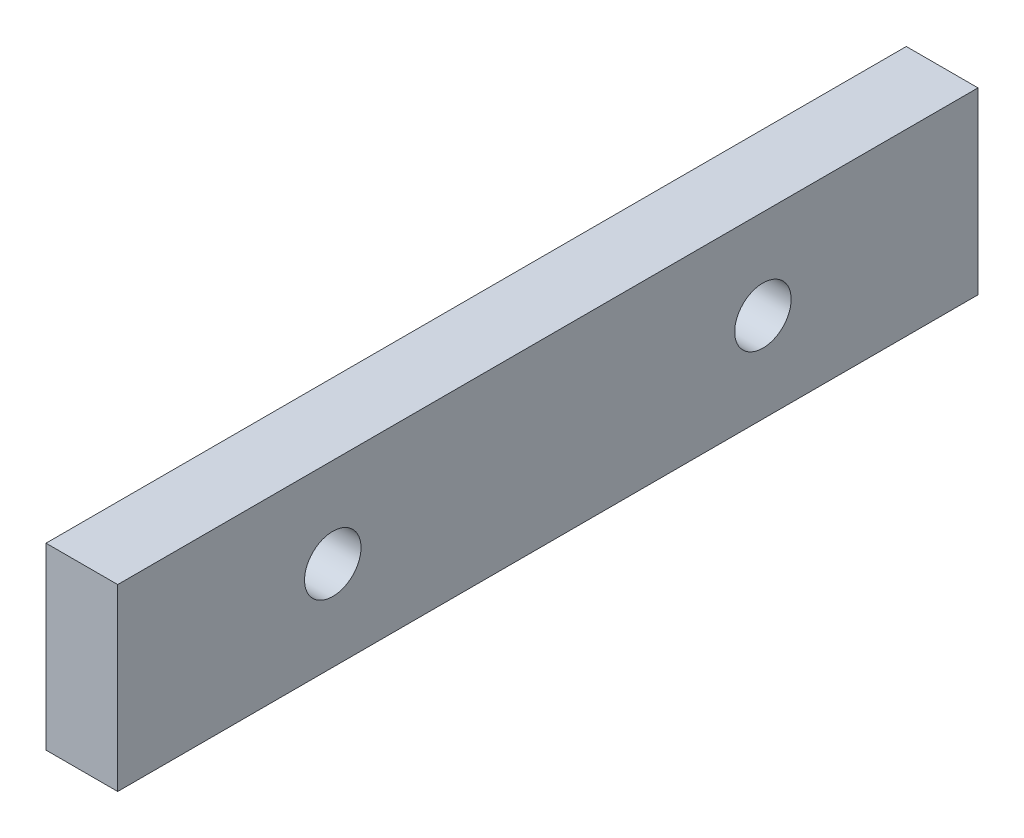
ISO-10303-21;
HEADER;
FILE_DESCRIPTION(('STEP AP214'),'2;1');
FILE_NAME('part.step','',(''),(''),'','','');
FILE_SCHEMA(('AUTOMOTIVE_DESIGN { 1 0 10303 214 1 1 1 1 }'));
ENDSEC;
DATA;
#1=APPLICATION_CONTEXT('core data for automotive mechanical design processes');
#2=APPLICATION_PROTOCOL_DEFINITION('international standard','automotive_design',2000,#1);
#3=PRODUCT_CONTEXT('',#1,'mechanical');
#4=PRODUCT('Part','Part','',(#3));
#5=PRODUCT_RELATED_PRODUCT_CATEGORY('part','',(#4));
#6=PRODUCT_DEFINITION_FORMATION('','',#4);
#7=PRODUCT_DEFINITION_CONTEXT('part definition',#1,'design');
#8=PRODUCT_DEFINITION('design','',#6,#7);
#9=PRODUCT_DEFINITION_SHAPE('','',#8);
#10=(LENGTH_UNIT() NAMED_UNIT(*) SI_UNIT(.MILLI.,.METRE.));
#11=(NAMED_UNIT(*) PLANE_ANGLE_UNIT() SI_UNIT($,.RADIAN.));
#12=(NAMED_UNIT(*) SI_UNIT($,.STERADIAN.) SOLID_ANGLE_UNIT());
#13=UNCERTAINTY_MEASURE_WITH_UNIT(LENGTH_MEASURE(1.E-05),#10,'distance_accuracy_value','');
#14=(GEOMETRIC_REPRESENTATION_CONTEXT(3) GLOBAL_UNCERTAINTY_ASSIGNED_CONTEXT((#13)) GLOBAL_UNIT_ASSIGNED_CONTEXT((#10,
#11,#12)) REPRESENTATION_CONTEXT('',''));
#15=CARTESIAN_POINT('',(0.,0.,0.));
#16=DIRECTION('',(0.,0.,1.));
#17=DIRECTION('',(1.,0.,0.));
#18=AXIS2_PLACEMENT_3D('',#15,#16,#17);
#19=CARTESIAN_POINT('',(3.175,7.9375,38.1));
#20=DIRECTION('',(-1.,0.,0.));
#21=DIRECTION('',(0.,-1.,0.));
#22=AXIS2_PLACEMENT_3D('',#19,#20,#21);
#23=PLANE('',#22);
#24=CARTESIAN_POINT('',(3.175,0.,19.05));
#25=DIRECTION('',(1.,0.,0.));
#26=DIRECTION('',(0.,0.,-1.));
#27=AXIS2_PLACEMENT_3D('',#24,#25,#26);
#28=CIRCLE('',#27,2.49999999999999);
#29=CARTESIAN_POINT('',(3.175,0.,16.55));
#30=VERTEX_POINT('',#29);
#31=EDGE_CURVE('E142',#30,#30,#28,.T.);
#32=ORIENTED_EDGE('',*,*,#31,.F.);
#33=EDGE_LOOP('',(#32));
#34=FACE_BOUND('',#33,.T.);
#35=DIRECTION('',(0.,1.,0.));
#36=VECTOR('',#35,1.);
#37=CARTESIAN_POINT('',(3.175,7.9375,-38.1));
#38=LINE('',#37,#36);
#39=CARTESIAN_POINT('',(3.175,-7.9375,-38.1));
#40=VERTEX_POINT('',#39);
#41=CARTESIAN_POINT('',(3.175,7.9375,-38.1));
#42=VERTEX_POINT('',#41);
#43=EDGE_CURVE('E109',#40,#42,#38,.T.);
#44=ORIENTED_EDGE('',*,*,#43,.T.);
#45=DIRECTION('',(0.,0.,-1.));
#46=VECTOR('',#45,1.);
#47=CARTESIAN_POINT('',(3.175,7.9375,38.1));
#48=LINE('',#47,#46);
#49=CARTESIAN_POINT('',(3.175,7.9375,38.1));
#50=VERTEX_POINT('',#49);
#51=EDGE_CURVE('E11',#50,#42,#48,.T.);
#52=ORIENTED_EDGE('',*,*,#51,.F.);
#53=DIRECTION('',(0.,1.,0.));
#54=VECTOR('',#53,1.);
#55=CARTESIAN_POINT('',(3.175,7.9375,38.1));
#56=LINE('',#55,#54);
#57=CARTESIAN_POINT('',(3.175,-7.9375,38.1));
#58=VERTEX_POINT('',#57);
#59=EDGE_CURVE('E93',#58,#50,#56,.T.);
#60=ORIENTED_EDGE('',*,*,#59,.F.);
#61=DIRECTION('',(0.,0.,-1.));
#62=VECTOR('',#61,1.);
#63=CARTESIAN_POINT('',(3.175,-7.9375,38.1));
#64=LINE('',#63,#62);
#65=EDGE_CURVE('E105',#58,#40,#64,.T.);
#66=ORIENTED_EDGE('',*,*,#65,.T.);
#67=EDGE_LOOP('',(#44,#52,#60,#66));
#68=FACE_BOUND('',#67,.T.);
#69=CARTESIAN_POINT('',(3.175,0.,-19.05));
#70=DIRECTION('',(1.,0.,0.));
#71=DIRECTION('',(0.,0.,-1.));
#72=AXIS2_PLACEMENT_3D('',#69,#70,#71);
#73=CIRCLE('',#72,2.49999999999999);
#74=CARTESIAN_POINT('',(3.175,0.,-21.55));
#75=VERTEX_POINT('',#74);
#76=EDGE_CURVE('E134',#75,#75,#73,.T.);
#77=ORIENTED_EDGE('',*,*,#76,.F.);
#78=EDGE_LOOP('',(#77));
#79=FACE_BOUND('',#78,.T.);
#80=ADVANCED_FACE('F41',(#34,#68,#79),#23,.F.);
#81=CARTESIAN_POINT('',(-3.175,7.9375,38.1));
#82=DIRECTION('',(0.,-1.,0.));
#83=DIRECTION('',(0.,0.,-1.));
#84=AXIS2_PLACEMENT_3D('',#81,#82,#83);
#85=PLANE('',#84);
#86=DIRECTION('',(-1.,0.,0.));
#87=VECTOR('',#86,1.);
#88=CARTESIAN_POINT('',(-3.175,7.9375,-38.1));
#89=LINE('',#88,#87);
#90=CARTESIAN_POINT('',(-3.175,7.9375,-38.1));
#91=VERTEX_POINT('',#90);
#92=EDGE_CURVE('E98',#42,#91,#89,.T.);
#93=ORIENTED_EDGE('',*,*,#92,.T.);
#94=DIRECTION('',(0.,0.,-1.));
#95=VECTOR('',#94,1.);
#96=CARTESIAN_POINT('',(-3.175,7.9375,38.1));
#97=LINE('',#96,#95);
#98=CARTESIAN_POINT('',(-3.175,7.9375,38.1));
#99=VERTEX_POINT('',#98);
#100=EDGE_CURVE('E50',#99,#91,#97,.T.);
#101=ORIENTED_EDGE('',*,*,#100,.F.);
#102=DIRECTION('',(-1.,0.,0.));
#103=VECTOR('',#102,1.);
#104=CARTESIAN_POINT('',(-3.175,7.9375,38.1));
#105=LINE('',#104,#103);
#106=EDGE_CURVE('E88',#50,#99,#105,.T.);
#107=ORIENTED_EDGE('',*,*,#106,.F.);
#108=ORIENTED_EDGE('',*,*,#51,.T.);
#109=EDGE_LOOP('',(#93,#101,#107,#108));
#110=FACE_BOUND('',#109,.T.);
#111=ADVANCED_FACE('F97',(#110),#85,.F.);
#112=CARTESIAN_POINT('',(-3.175,7.9375,38.1));
#113=DIRECTION('',(1.,0.,0.));
#114=DIRECTION('',(0.,1.,0.));
#115=AXIS2_PLACEMENT_3D('',#112,#113,#114);
#116=PLANE('',#115);
#117=CARTESIAN_POINT('',(-3.175,0.,19.05));
#118=DIRECTION('',(1.,0.,0.));
#119=DIRECTION('',(0.,1.,0.));
#120=AXIS2_PLACEMENT_3D('',#117,#118,#119);
#121=CIRCLE('',#120,2.49999999999999);
#122=CARTESIAN_POINT('',(-3.175,2.5,19.05));
#123=VERTEX_POINT('',#122);
#124=EDGE_CURVE('E138',#123,#123,#121,.T.);
#125=ORIENTED_EDGE('',*,*,#124,.T.);
#126=EDGE_LOOP('',(#125));
#127=FACE_BOUND('',#126,.T.);
#128=CARTESIAN_POINT('',(-3.175,0.,-19.05));
#129=DIRECTION('',(1.,0.,0.));
#130=DIRECTION('',(0.,1.,0.));
#131=AXIS2_PLACEMENT_3D('',#128,#129,#130);
#132=CIRCLE('',#131,2.49999999999999);
#133=CARTESIAN_POINT('',(-3.175,2.5,-19.05));
#134=VERTEX_POINT('',#133);
#135=EDGE_CURVE('E113',#134,#134,#132,.T.);
#136=ORIENTED_EDGE('',*,*,#135,.T.);
#137=EDGE_LOOP('',(#136));
#138=FACE_BOUND('',#137,.T.);
#139=DIRECTION('',(0.,-1.,0.));
#140=VECTOR('',#139,1.);
#141=CARTESIAN_POINT('',(-3.175,7.9375,-38.1));
#142=LINE('',#141,#140);
#143=CARTESIAN_POINT('',(-3.175,-7.9375,-38.1));
#144=VERTEX_POINT('',#143);
#145=EDGE_CURVE('E75',#91,#144,#142,.T.);
#146=ORIENTED_EDGE('',*,*,#145,.T.);
#147=DIRECTION('',(0.,0.,-1.));
#148=VECTOR('',#147,1.);
#149=CARTESIAN_POINT('',(-3.175,-7.9375,38.1));
#150=LINE('',#149,#148);
#151=CARTESIAN_POINT('',(-3.175,-7.9375,38.1));
#152=VERTEX_POINT('',#151);
#153=EDGE_CURVE('E100',#152,#144,#150,.T.);
#154=ORIENTED_EDGE('',*,*,#153,.F.);
#155=DIRECTION('',(0.,-1.,0.));
#156=VECTOR('',#155,1.);
#157=CARTESIAN_POINT('',(-3.175,7.9375,38.1));
#158=LINE('',#157,#156);
#159=EDGE_CURVE('E91',#99,#152,#158,.T.);
#160=ORIENTED_EDGE('',*,*,#159,.F.);
#161=ORIENTED_EDGE('',*,*,#100,.T.);
#162=EDGE_LOOP('',(#146,#154,#160,#161));
#163=FACE_BOUND('',#162,.T.);
#164=ADVANCED_FACE('F101',(#127,#138,#163),#116,.F.);
#165=CARTESIAN_POINT('',(-3.175,-7.9375,38.1));
#166=DIRECTION('',(0.,1.,0.));
#167=DIRECTION('',(0.,0.,1.));
#168=AXIS2_PLACEMENT_3D('',#165,#166,#167);
#169=PLANE('',#168);
#170=DIRECTION('',(1.,0.,0.));
#171=VECTOR('',#170,1.);
#172=CARTESIAN_POINT('',(-3.175,-7.9375,-38.1));
#173=LINE('',#172,#171);
#174=EDGE_CURVE('E81',#144,#40,#173,.T.);
#175=ORIENTED_EDGE('',*,*,#174,.T.);
#176=ORIENTED_EDGE('',*,*,#65,.F.);
#177=DIRECTION('',(1.,0.,0.));
#178=VECTOR('',#177,1.);
#179=CARTESIAN_POINT('',(-3.175,-7.9375,38.1));
#180=LINE('',#179,#178);
#181=EDGE_CURVE('E58',#152,#58,#180,.T.);
#182=ORIENTED_EDGE('',*,*,#181,.F.);
#183=ORIENTED_EDGE('',*,*,#153,.T.);
#184=EDGE_LOOP('',(#175,#176,#182,#183));
#185=FACE_BOUND('',#184,.T.);
#186=ADVANCED_FACE('F123',(#185),#169,.F.);
#187=CARTESIAN_POINT('',(3.175,-7.9375,38.1));
#188=DIRECTION('',(0.,0.,1.));
#189=DIRECTION('',(1.,0.,0.));
#190=AXIS2_PLACEMENT_3D('',#187,#188,#189);
#191=PLANE('',#190);
#192=ORIENTED_EDGE('',*,*,#59,.T.);
#193=ORIENTED_EDGE('',*,*,#106,.T.);
#194=ORIENTED_EDGE('',*,*,#159,.T.);
#195=ORIENTED_EDGE('',*,*,#181,.T.);
#196=EDGE_LOOP('',(#192,#193,#194,#195));
#197=FACE_BOUND('',#196,.T.);
#198=ADVANCED_FACE('F89',(#197),#191,.T.);
#199=CARTESIAN_POINT('',(3.175,-7.9375,-38.1));
#200=DIRECTION('',(0.,0.,1.));
#201=DIRECTION('',(1.,0.,0.));
#202=AXIS2_PLACEMENT_3D('',#199,#200,#201);
#203=PLANE('',#202);
#204=ORIENTED_EDGE('',*,*,#43,.F.);
#205=ORIENTED_EDGE('',*,*,#174,.F.);
#206=ORIENTED_EDGE('',*,*,#145,.F.);
#207=ORIENTED_EDGE('',*,*,#92,.F.);
#208=EDGE_LOOP('',(#204,#205,#206,#207));
#209=FACE_BOUND('',#208,.T.);
#210=ADVANCED_FACE('F126',(#209),#203,.F.);
#211=CARTESIAN_POINT('',(3.175,0.,-19.05));
#212=DIRECTION('',(1.,0.,0.));
#213=DIRECTION('',(0.,0.,-1.));
#214=AXIS2_PLACEMENT_3D('',#211,#212,#213);
#215=CYLINDRICAL_SURFACE('',#214,2.49999999999999);
#216=ORIENTED_EDGE('',*,*,#135,.F.);
#217=EDGE_LOOP('',(#216));
#218=FACE_BOUND('',#217,.T.);
#219=ORIENTED_EDGE('',*,*,#76,.T.);
#220=EDGE_LOOP('',(#219));
#221=FACE_BOUND('',#220,.T.);
#222=ADVANCED_FACE('F163',(#218,#221),#215,.F.);
#223=CARTESIAN_POINT('',(3.175,0.,19.05));
#224=DIRECTION('',(1.,0.,0.));
#225=DIRECTION('',(0.,0.,-1.));
#226=AXIS2_PLACEMENT_3D('',#223,#224,#225);
#227=CYLINDRICAL_SURFACE('',#226,2.49999999999999);
#228=ORIENTED_EDGE('',*,*,#124,.F.);
#229=EDGE_LOOP('',(#228));
#230=FACE_BOUND('',#229,.T.);
#231=ORIENTED_EDGE('',*,*,#31,.T.);
#232=EDGE_LOOP('',(#231));
#233=FACE_BOUND('',#232,.T.);
#234=ADVANCED_FACE('F147',(#230,#233),#227,.F.);
#235=CLOSED_SHELL('',(#80,#111,#164,#186,#198,#210,#222,#234));
#236=MANIFOLD_SOLID_BREP('B2',#235);
#237=ADVANCED_BREP_SHAPE_REPRESENTATION('',(#18,#236),#14);
#238=SHAPE_DEFINITION_REPRESENTATION(#9,#237);
ENDSEC;
END-ISO-10303-21;
